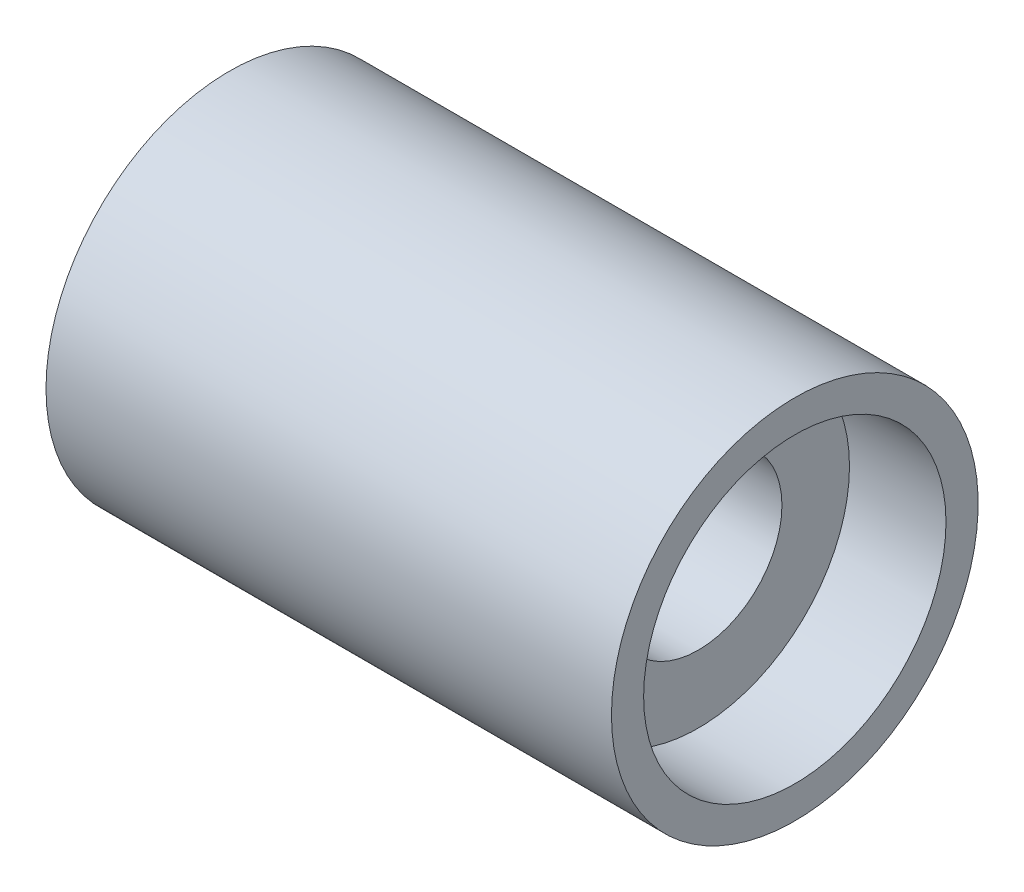
ISO-10303-21;
HEADER;
FILE_DESCRIPTION(('STEP AP214'),'2;1');
FILE_NAME('part.step','',(''),(''),'','','');
FILE_SCHEMA(('AUTOMOTIVE_DESIGN { 1 0 10303 214 1 1 1 1 }'));
ENDSEC;
DATA;
#1=APPLICATION_CONTEXT('core data for automotive mechanical design processes');
#2=APPLICATION_PROTOCOL_DEFINITION('international standard','automotive_design',2000,#1);
#3=PRODUCT_CONTEXT('',#1,'mechanical');
#4=PRODUCT('Part','Part','',(#3));
#5=PRODUCT_RELATED_PRODUCT_CATEGORY('part','',(#4));
#6=PRODUCT_DEFINITION_FORMATION('','',#4);
#7=PRODUCT_DEFINITION_CONTEXT('part definition',#1,'design');
#8=PRODUCT_DEFINITION('design','',#6,#7);
#9=PRODUCT_DEFINITION_SHAPE('','',#8);
#10=(LENGTH_UNIT() NAMED_UNIT(*) SI_UNIT(.MILLI.,.METRE.));
#11=(NAMED_UNIT(*) PLANE_ANGLE_UNIT() SI_UNIT($,.RADIAN.));
#12=(NAMED_UNIT(*) SI_UNIT($,.STERADIAN.) SOLID_ANGLE_UNIT());
#13=UNCERTAINTY_MEASURE_WITH_UNIT(LENGTH_MEASURE(1.E-05),#10,'distance_accuracy_value','');
#14=(GEOMETRIC_REPRESENTATION_CONTEXT(3) GLOBAL_UNCERTAINTY_ASSIGNED_CONTEXT((#13)) GLOBAL_UNIT_ASSIGNED_CONTEXT((#10,
#11,#12)) REPRESENTATION_CONTEXT('',''));
#15=CARTESIAN_POINT('',(0.,0.,0.));
#16=DIRECTION('',(0.,0.,1.));
#17=DIRECTION('',(1.,0.,0.));
#18=AXIS2_PLACEMENT_3D('',#15,#16,#17);
#19=CARTESIAN_POINT('',(43.9500000000001,23.5,0.));
#20=DIRECTION('',(-1.,0.,0.));
#21=DIRECTION('',(0.,0.,1.));
#22=AXIS2_PLACEMENT_3D('',#19,#20,#21);
#23=PLANE('',#22);
#24=CARTESIAN_POINT('',(43.9500000000001,0.,0.));
#25=DIRECTION('',(-1.,0.,0.));
#26=DIRECTION('',(0.,0.,1.));
#27=AXIS2_PLACEMENT_3D('',#24,#25,#26);
#28=CIRCLE('',#27,28.5);
#29=CARTESIAN_POINT('',(43.9500000000001,0.,28.5));
#30=VERTEX_POINT('',#29);
#31=EDGE_CURVE('E63',#30,#30,#28,.T.);
#32=ORIENTED_EDGE('',*,*,#31,.F.);
#33=EDGE_LOOP('',(#32));
#34=FACE_BOUND('',#33,.T.);
#35=CARTESIAN_POINT('',(43.9500000000001,0.,0.));
#36=DIRECTION('',(-1.,0.,0.));
#37=DIRECTION('',(0.,0.,1.));
#38=AXIS2_PLACEMENT_3D('',#35,#36,#37);
#39=CIRCLE('',#38,23.5);
#40=CARTESIAN_POINT('',(43.9500000000001,0.,23.5));
#41=VERTEX_POINT('',#40);
#42=EDGE_CURVE('E10',#41,#41,#39,.T.);
#43=ORIENTED_EDGE('',*,*,#42,.T.);
#44=EDGE_LOOP('',(#43));
#45=FACE_BOUND('',#44,.T.);
#46=ADVANCED_FACE('F35',(#34,#45),#23,.F.);
#47=CARTESIAN_POINT('',(-28.010573724373,0.,0.));
#48=DIRECTION('',(-1.,0.,0.));
#49=DIRECTION('',(0.,0.,1.));
#50=AXIS2_PLACEMENT_3D('',#47,#48,#49);
#51=CYLINDRICAL_SURFACE('',#50,23.5);
#52=ORIENTED_EDGE('',*,*,#42,.F.);
#53=EDGE_LOOP('',(#52));
#54=FACE_BOUND('',#53,.T.);
#55=CARTESIAN_POINT('',(28.9500000000001,0.,0.));
#56=DIRECTION('',(-1.,0.,0.));
#57=DIRECTION('',(0.,0.,1.));
#58=AXIS2_PLACEMENT_3D('',#55,#56,#57);
#59=CIRCLE('',#58,23.5);
#60=CARTESIAN_POINT('',(28.9500000000001,0.,23.5));
#61=VERTEX_POINT('',#60);
#62=EDGE_CURVE('E41',#61,#61,#59,.T.);
#63=ORIENTED_EDGE('',*,*,#62,.T.);
#64=EDGE_LOOP('',(#63));
#65=FACE_BOUND('',#64,.T.);
#66=ADVANCED_FACE('F70',(#54,#65),#51,.F.);
#67=CARTESIAN_POINT('',(28.9500000000001,13.,0.));
#68=DIRECTION('',(-1.,0.,0.));
#69=DIRECTION('',(0.,0.,1.));
#70=AXIS2_PLACEMENT_3D('',#67,#68,#69);
#71=PLANE('',#70);
#72=ORIENTED_EDGE('',*,*,#62,.F.);
#73=EDGE_LOOP('',(#72));
#74=FACE_BOUND('',#73,.T.);
#75=CARTESIAN_POINT('',(28.9500000000001,0.,0.));
#76=DIRECTION('',(-1.,0.,0.));
#77=DIRECTION('',(0.,0.,1.));
#78=AXIS2_PLACEMENT_3D('',#75,#76,#77);
#79=CIRCLE('',#78,13.);
#80=CARTESIAN_POINT('',(28.9500000000001,0.,13.));
#81=VERTEX_POINT('',#80);
#82=EDGE_CURVE('E45',#81,#81,#79,.T.);
#83=ORIENTED_EDGE('',*,*,#82,.T.);
#84=EDGE_LOOP('',(#83));
#85=FACE_BOUND('',#84,.T.);
#86=ADVANCED_FACE('F74',(#74,#85),#71,.F.);
#87=CARTESIAN_POINT('',(-28.010573724373,0.,0.));
#88=DIRECTION('',(-1.,0.,0.));
#89=DIRECTION('',(0.,0.,1.));
#90=AXIS2_PLACEMENT_3D('',#87,#88,#89);
#91=CYLINDRICAL_SURFACE('',#90,13.);
#92=ORIENTED_EDGE('',*,*,#82,.F.);
#93=EDGE_LOOP('',(#92));
#94=FACE_BOUND('',#93,.T.);
#95=CARTESIAN_POINT('',(-28.9499999999999,0.,0.));
#96=DIRECTION('',(-1.,0.,0.));
#97=DIRECTION('',(0.,0.,1.));
#98=AXIS2_PLACEMENT_3D('',#95,#96,#97);
#99=CIRCLE('',#98,13.);
#100=CARTESIAN_POINT('',(-28.9499999999999,0.,13.));
#101=VERTEX_POINT('',#100);
#102=EDGE_CURVE('E49',#101,#101,#99,.T.);
#103=ORIENTED_EDGE('',*,*,#102,.T.);
#104=EDGE_LOOP('',(#103));
#105=FACE_BOUND('',#104,.T.);
#106=ADVANCED_FACE('F79',(#94,#105),#91,.F.);
#107=CARTESIAN_POINT('',(-28.9499999999999,13.,0.));
#108=DIRECTION('',(1.,0.,0.));
#109=DIRECTION('',(0.,0.,-1.));
#110=AXIS2_PLACEMENT_3D('',#107,#108,#109);
#111=PLANE('',#110);
#112=ORIENTED_EDGE('',*,*,#102,.F.);
#113=EDGE_LOOP('',(#112));
#114=FACE_BOUND('',#113,.T.);
#115=CARTESIAN_POINT('',(-28.9499999999999,0.,0.));
#116=DIRECTION('',(-1.,0.,0.));
#117=DIRECTION('',(0.,0.,1.));
#118=AXIS2_PLACEMENT_3D('',#115,#116,#117);
#119=CIRCLE('',#118,23.5);
#120=CARTESIAN_POINT('',(-28.9499999999999,0.,23.5));
#121=VERTEX_POINT('',#120);
#122=EDGE_CURVE('E54',#121,#121,#119,.T.);
#123=ORIENTED_EDGE('',*,*,#122,.T.);
#124=EDGE_LOOP('',(#123));
#125=FACE_BOUND('',#124,.T.);
#126=ADVANCED_FACE('F85',(#114,#125),#111,.F.);
#127=CARTESIAN_POINT('',(-28.010573724373,0.,0.));
#128=DIRECTION('',(-1.,0.,0.));
#129=DIRECTION('',(0.,0.,1.));
#130=AXIS2_PLACEMENT_3D('',#127,#128,#129);
#131=CYLINDRICAL_SURFACE('',#130,23.5);
#132=ORIENTED_EDGE('',*,*,#122,.F.);
#133=EDGE_LOOP('',(#132));
#134=FACE_BOUND('',#133,.T.);
#135=CARTESIAN_POINT('',(-43.9499999999999,0.,0.));
#136=DIRECTION('',(-1.,0.,0.));
#137=DIRECTION('',(0.,0.,1.));
#138=AXIS2_PLACEMENT_3D('',#135,#136,#137);
#139=CIRCLE('',#138,23.5);
#140=CARTESIAN_POINT('',(-43.9499999999999,0.,23.5));
#141=VERTEX_POINT('',#140);
#142=EDGE_CURVE('E57',#141,#141,#139,.T.);
#143=ORIENTED_EDGE('',*,*,#142,.T.);
#144=EDGE_LOOP('',(#143));
#145=FACE_BOUND('',#144,.T.);
#146=ADVANCED_FACE('F89',(#134,#145),#131,.F.);
#147=CARTESIAN_POINT('',(-43.9499999999999,23.5,0.));
#148=DIRECTION('',(1.,0.,0.));
#149=DIRECTION('',(0.,0.,-1.));
#150=AXIS2_PLACEMENT_3D('',#147,#148,#149);
#151=PLANE('',#150);
#152=ORIENTED_EDGE('',*,*,#142,.F.);
#153=EDGE_LOOP('',(#152));
#154=FACE_BOUND('',#153,.T.);
#155=CARTESIAN_POINT('',(-43.9499999999999,0.,0.));
#156=DIRECTION('',(-1.,0.,0.));
#157=DIRECTION('',(0.,0.,1.));
#158=AXIS2_PLACEMENT_3D('',#155,#156,#157);
#159=CIRCLE('',#158,28.5);
#160=CARTESIAN_POINT('',(-43.9499999999999,0.,28.5));
#161=VERTEX_POINT('',#160);
#162=EDGE_CURVE('E60',#161,#161,#159,.T.);
#163=ORIENTED_EDGE('',*,*,#162,.T.);
#164=EDGE_LOOP('',(#163));
#165=FACE_BOUND('',#164,.T.);
#166=ADVANCED_FACE('F93',(#154,#165),#151,.F.);
#167=CARTESIAN_POINT('',(-28.010573724373,0.,0.));
#168=DIRECTION('',(-1.,0.,0.));
#169=DIRECTION('',(0.,0.,1.));
#170=AXIS2_PLACEMENT_3D('',#167,#168,#169);
#171=CYLINDRICAL_SURFACE('',#170,28.5);
#172=ORIENTED_EDGE('',*,*,#162,.F.);
#173=EDGE_LOOP('',(#172));
#174=FACE_BOUND('',#173,.T.);
#175=ORIENTED_EDGE('',*,*,#31,.T.);
#176=EDGE_LOOP('',(#175));
#177=FACE_BOUND('',#176,.T.);
#178=ADVANCED_FACE('F67',(#174,#177),#171,.T.);
#179=CLOSED_SHELL('',(#46,#66,#86,#106,#126,#146,#166,#178));
#180=MANIFOLD_SOLID_BREP('B2',#179);
#181=ADVANCED_BREP_SHAPE_REPRESENTATION('',(#18,#180),#14);
#182=SHAPE_DEFINITION_REPRESENTATION(#9,#181);
ENDSEC;
END-ISO-10303-21;
